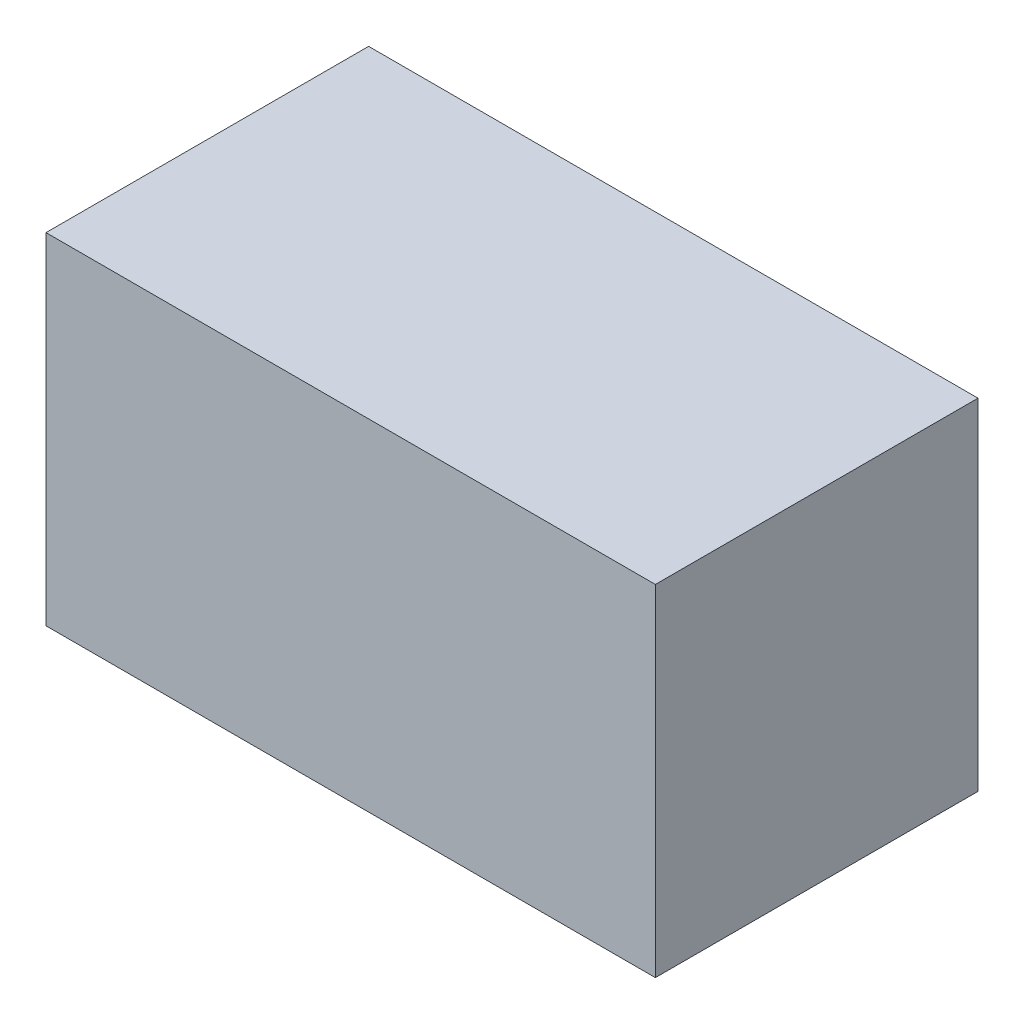
ISO-10303-21;
HEADER;
FILE_DESCRIPTION(('STEP AP214'),'2;1');
FILE_NAME('part.step','',(''),(''),'','','');
FILE_SCHEMA(('AUTOMOTIVE_DESIGN { 1 0 10303 214 1 1 1 1 }'));
ENDSEC;
DATA;
#1=APPLICATION_CONTEXT('core data for automotive mechanical design processes');
#2=APPLICATION_PROTOCOL_DEFINITION('international standard','automotive_design',2000,#1);
#3=PRODUCT_CONTEXT('',#1,'mechanical');
#4=PRODUCT('Part','Part','',(#3));
#5=PRODUCT_RELATED_PRODUCT_CATEGORY('part','',(#4));
#6=PRODUCT_DEFINITION_FORMATION('','',#4);
#7=PRODUCT_DEFINITION_CONTEXT('part definition',#1,'design');
#8=PRODUCT_DEFINITION('design','',#6,#7);
#9=PRODUCT_DEFINITION_SHAPE('','',#8);
#10=(LENGTH_UNIT() NAMED_UNIT(*) SI_UNIT(.MILLI.,.METRE.));
#11=(NAMED_UNIT(*) PLANE_ANGLE_UNIT() SI_UNIT($,.RADIAN.));
#12=(NAMED_UNIT(*) SI_UNIT($,.STERADIAN.) SOLID_ANGLE_UNIT());
#13=UNCERTAINTY_MEASURE_WITH_UNIT(LENGTH_MEASURE(1.E-05),#10,'distance_accuracy_value','');
#14=(GEOMETRIC_REPRESENTATION_CONTEXT(3) GLOBAL_UNCERTAINTY_ASSIGNED_CONTEXT((#13)) GLOBAL_UNIT_ASSIGNED_CONTEXT((#10,
#11,#12)) REPRESENTATION_CONTEXT('',''));
#15=CARTESIAN_POINT('',(0.,0.,0.));
#16=DIRECTION('',(0.,0.,1.));
#17=DIRECTION('',(1.,0.,0.));
#18=AXIS2_PLACEMENT_3D('',#15,#16,#17);
#19=CARTESIAN_POINT('',(-0.85000084,-0.47500032,0.90000074));
#20=DIRECTION('',(0.,0.,-1.));
#21=DIRECTION('',(-1.,0.,0.));
#22=AXIS2_PLACEMENT_3D('',#19,#20,#21);
#23=PLANE('',#22);
#24=DIRECTION('',(0.,1.,0.));
#25=VECTOR('',#24,1.);
#26=CARTESIAN_POINT('',(0.85000084,-0.47500032,0.90000074));
#27=LINE('',#26,#25);
#28=CARTESIAN_POINT('',(0.85000084,-0.47500032,0.90000074));
#29=VERTEX_POINT('',#28);
#30=CARTESIAN_POINT('',(0.85000084,0.47500032,0.90000074));
#31=VERTEX_POINT('',#30);
#32=EDGE_CURVE('E55',#29,#31,#27,.T.);
#33=ORIENTED_EDGE('',*,*,#32,.T.);
#34=DIRECTION('',(1.,0.,0.));
#35=VECTOR('',#34,1.);
#36=CARTESIAN_POINT('',(0.85000084,0.47500032,0.90000074));
#37=LINE('',#36,#35);
#38=CARTESIAN_POINT('',(-0.85000084,0.47500032,0.90000074));
#39=VERTEX_POINT('',#38);
#40=EDGE_CURVE('E57',#31,#39,#37,.F.);
#41=ORIENTED_EDGE('',*,*,#40,.T.);
#42=DIRECTION('',(0.,1.,0.));
#43=VECTOR('',#42,1.);
#44=CARTESIAN_POINT('',(-0.85000084,0.47500032,0.90000074));
#45=LINE('',#44,#43);
#46=CARTESIAN_POINT('',(-0.85000084,-0.47500032,0.90000074));
#47=VERTEX_POINT('',#46);
#48=EDGE_CURVE('E20',#39,#47,#45,.F.);
#49=ORIENTED_EDGE('',*,*,#48,.T.);
#50=DIRECTION('',(1.,0.,0.));
#51=VECTOR('',#50,1.);
#52=CARTESIAN_POINT('',(-0.85000084,-0.47500032,0.90000074));
#53=LINE('',#52,#51);
#54=EDGE_CURVE('E80',#47,#29,#53,.T.);
#55=ORIENTED_EDGE('',*,*,#54,.T.);
#56=EDGE_LOOP('',(#33,#41,#49,#55));
#57=FACE_BOUND('',#56,.T.);
#58=ADVANCED_FACE('F17',(#57),#23,.F.);
#59=CARTESIAN_POINT('',(-0.85000084,0.47500032,0.));
#60=DIRECTION('',(1.,0.,0.));
#61=DIRECTION('',(0.,0.,-1.));
#62=AXIS2_PLACEMENT_3D('',#59,#60,#61);
#63=PLANE('',#62);
#64=DIRECTION('',(0.,0.,1.));
#65=VECTOR('',#64,1.);
#66=CARTESIAN_POINT('',(-0.85000084,-0.47500032,0.));
#67=LINE('',#66,#65);
#68=CARTESIAN_POINT('',(-0.85000084,-0.47500032,0.));
#69=VERTEX_POINT('',#68);
#70=EDGE_CURVE('E68',#69,#47,#67,.T.);
#71=ORIENTED_EDGE('',*,*,#70,.T.);
#72=ORIENTED_EDGE('',*,*,#48,.F.);
#73=DIRECTION('',(0.,0.,-1.));
#74=VECTOR('',#73,1.);
#75=CARTESIAN_POINT('',(-0.85000084,0.47500032,0.));
#76=LINE('',#75,#74);
#77=CARTESIAN_POINT('',(-0.85000084,0.47500032,0.));
#78=VERTEX_POINT('',#77);
#79=EDGE_CURVE('E63',#39,#78,#76,.T.);
#80=ORIENTED_EDGE('',*,*,#79,.T.);
#81=DIRECTION('',(0.,1.,0.));
#82=VECTOR('',#81,1.);
#83=CARTESIAN_POINT('',(-0.85000084,-0.47500032,0.));
#84=LINE('',#83,#82);
#85=EDGE_CURVE('E83',#69,#78,#84,.T.);
#86=ORIENTED_EDGE('',*,*,#85,.F.);
#87=EDGE_LOOP('',(#71,#72,#80,#86));
#88=FACE_BOUND('',#87,.T.);
#89=ADVANCED_FACE('F65',(#88),#63,.F.);
#90=CARTESIAN_POINT('',(0.85000084,0.47500032,0.));
#91=DIRECTION('',(0.,-1.,0.));
#92=DIRECTION('',(0.,0.,-1.));
#93=AXIS2_PLACEMENT_3D('',#90,#91,#92);
#94=PLANE('',#93);
#95=ORIENTED_EDGE('',*,*,#79,.F.);
#96=ORIENTED_EDGE('',*,*,#40,.F.);
#97=DIRECTION('',(0.,0.,1.));
#98=VECTOR('',#97,1.);
#99=CARTESIAN_POINT('',(0.85000084,0.47500032,0.));
#100=LINE('',#99,#98);
#101=CARTESIAN_POINT('',(0.85000084,0.47500032,0.));
#102=VERTEX_POINT('',#101);
#103=EDGE_CURVE('E75',#31,#102,#100,.F.);
#104=ORIENTED_EDGE('',*,*,#103,.T.);
#105=DIRECTION('',(-1.,0.,0.));
#106=VECTOR('',#105,1.);
#107=CARTESIAN_POINT('',(-0.85000084,0.47500032,0.));
#108=LINE('',#107,#106);
#109=EDGE_CURVE('E72',#78,#102,#108,.F.);
#110=ORIENTED_EDGE('',*,*,#109,.F.);
#111=EDGE_LOOP('',(#95,#96,#104,#110));
#112=FACE_BOUND('',#111,.T.);
#113=ADVANCED_FACE('F70',(#112),#94,.F.);
#114=CARTESIAN_POINT('',(0.85000084,-0.47500032,0.));
#115=DIRECTION('',(-1.,0.,0.));
#116=DIRECTION('',(0.,0.,1.));
#117=AXIS2_PLACEMENT_3D('',#114,#115,#116);
#118=PLANE('',#117);
#119=ORIENTED_EDGE('',*,*,#103,.F.);
#120=ORIENTED_EDGE('',*,*,#32,.F.);
#121=DIRECTION('',(0.,0.,1.));
#122=VECTOR('',#121,1.);
#123=CARTESIAN_POINT('',(0.85000084,-0.47500032,0.));
#124=LINE('',#123,#122);
#125=CARTESIAN_POINT('',(0.85000084,-0.47500032,0.));
#126=VERTEX_POINT('',#125);
#127=EDGE_CURVE('E35',#29,#126,#124,.F.);
#128=ORIENTED_EDGE('',*,*,#127,.T.);
#129=DIRECTION('',(0.,1.,0.));
#130=VECTOR('',#129,1.);
#131=CARTESIAN_POINT('',(0.85000084,-0.47500032,0.));
#132=LINE('',#131,#130);
#133=EDGE_CURVE('E26',#102,#126,#132,.F.);
#134=ORIENTED_EDGE('',*,*,#133,.F.);
#135=EDGE_LOOP('',(#119,#120,#128,#134));
#136=FACE_BOUND('',#135,.T.);
#137=ADVANCED_FACE('F89',(#136),#118,.F.);
#138=CARTESIAN_POINT('',(-0.85000084,-0.47500032,0.));
#139=DIRECTION('',(0.,1.,0.));
#140=DIRECTION('',(0.,0.,1.));
#141=AXIS2_PLACEMENT_3D('',#138,#139,#140);
#142=PLANE('',#141);
#143=ORIENTED_EDGE('',*,*,#127,.F.);
#144=ORIENTED_EDGE('',*,*,#54,.F.);
#145=ORIENTED_EDGE('',*,*,#70,.F.);
#146=DIRECTION('',(-1.,0.,0.));
#147=VECTOR('',#146,1.);
#148=CARTESIAN_POINT('',(-0.85000084,-0.47500032,0.));
#149=LINE('',#148,#147);
#150=EDGE_CURVE('E11',#126,#69,#149,.T.);
#151=ORIENTED_EDGE('',*,*,#150,.F.);
#152=EDGE_LOOP('',(#143,#144,#145,#151));
#153=FACE_BOUND('',#152,.T.);
#154=ADVANCED_FACE('F91',(#153),#142,.F.);
#155=CARTESIAN_POINT('',(-0.85000084,-0.47500032,0.));
#156=DIRECTION('',(0.,0.,-1.));
#157=DIRECTION('',(-1.,0.,0.));
#158=AXIS2_PLACEMENT_3D('',#155,#156,#157);
#159=PLANE('',#158);
#160=ORIENTED_EDGE('',*,*,#133,.T.);
#161=ORIENTED_EDGE('',*,*,#150,.T.);
#162=ORIENTED_EDGE('',*,*,#85,.T.);
#163=ORIENTED_EDGE('',*,*,#109,.T.);
#164=EDGE_LOOP('',(#160,#161,#162,#163));
#165=FACE_BOUND('',#164,.T.);
#166=ADVANCED_FACE('F88',(#165),#159,.T.);
#167=CLOSED_SHELL('',(#58,#89,#113,#137,#154,#166));
#168=MANIFOLD_SOLID_BREP('B1',#167);
#169=ADVANCED_BREP_SHAPE_REPRESENTATION('',(#18,#168),#14);
#170=SHAPE_DEFINITION_REPRESENTATION(#9,#169);
ENDSEC;
END-ISO-10303-21;
